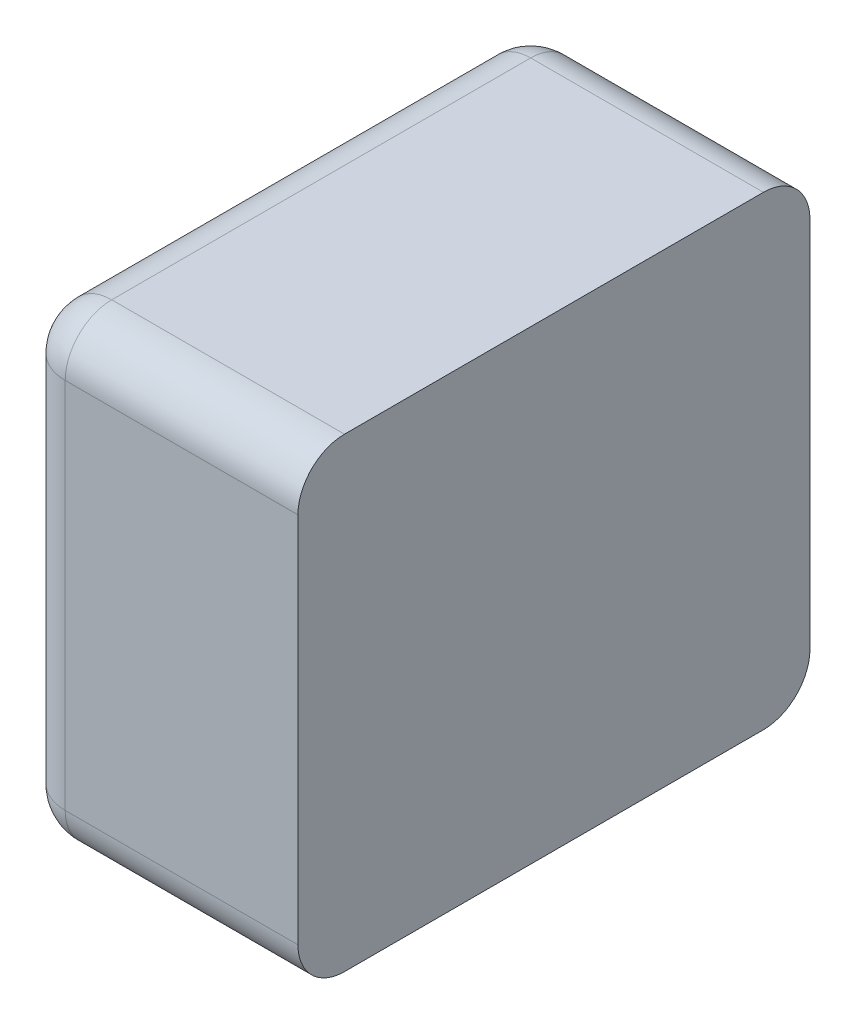
ISO-10303-21;
HEADER;
FILE_DESCRIPTION(('STEP AP214'),'2;1');
FILE_NAME('part.step','',(''),(''),'','','');
FILE_SCHEMA(('AUTOMOTIVE_DESIGN { 1 0 10303 214 1 1 1 1 }'));
ENDSEC;
DATA;
#1=APPLICATION_CONTEXT('core data for automotive mechanical design processes');
#2=APPLICATION_PROTOCOL_DEFINITION('international standard','automotive_design',2000,#1);
#3=PRODUCT_CONTEXT('',#1,'mechanical');
#4=PRODUCT('Part','Part','',(#3));
#5=PRODUCT_RELATED_PRODUCT_CATEGORY('part','',(#4));
#6=PRODUCT_DEFINITION_FORMATION('','',#4);
#7=PRODUCT_DEFINITION_CONTEXT('part definition',#1,'design');
#8=PRODUCT_DEFINITION('design','',#6,#7);
#9=PRODUCT_DEFINITION_SHAPE('','',#8);
#10=(LENGTH_UNIT() NAMED_UNIT(*) SI_UNIT(.MILLI.,.METRE.));
#11=(NAMED_UNIT(*) PLANE_ANGLE_UNIT() SI_UNIT($,.RADIAN.));
#12=(NAMED_UNIT(*) SI_UNIT($,.STERADIAN.) SOLID_ANGLE_UNIT());
#13=UNCERTAINTY_MEASURE_WITH_UNIT(LENGTH_MEASURE(1.E-05),#10,'distance_accuracy_value','');
#14=(GEOMETRIC_REPRESENTATION_CONTEXT(3) GLOBAL_UNCERTAINTY_ASSIGNED_CONTEXT((#13)) GLOBAL_UNIT_ASSIGNED_CONTEXT((#10,
#11,#12)) REPRESENTATION_CONTEXT('',''));
#15=CARTESIAN_POINT('',(0.,0.,0.));
#16=DIRECTION('',(0.,0.,1.));
#17=DIRECTION('',(1.,0.,0.));
#18=AXIS2_PLACEMENT_3D('',#15,#16,#17);
#19=CARTESIAN_POINT('',(-0.5,0.25,0.));
#20=DIRECTION('',(-1.,0.,0.));
#21=DIRECTION('',(0.,0.,1.));
#22=AXIS2_PLACEMENT_3D('',#19,#20,#21);
#23=PLANE('',#22);
#24=DIRECTION('',(0.,-1.,0.));
#25=VECTOR('',#24,1.);
#26=CARTESIAN_POINT('',(-0.5,0.125,0.05));
#27=LINE('',#26,#25);
#28=CARTESIAN_POINT('',(-0.5,-0.2,0.05));
#29=VERTEX_POINT('',#28);
#30=CARTESIAN_POINT('',(-0.5,0.2,0.05));
#31=VERTEX_POINT('',#30);
#32=EDGE_CURVE('E242',#29,#31,#27,.F.);
#33=ORIENTED_EDGE('',*,*,#32,.F.);
#34=DIRECTION('',(0.,0.,1.));
#35=VECTOR('',#34,1.);
#36=CARTESIAN_POINT('',(-0.5,-0.2,0.));
#37=LINE('',#36,#35);
#38=CARTESIAN_POINT('',(-0.5,-0.2,0.5));
#39=VERTEX_POINT('',#38);
#40=EDGE_CURVE('E103',#39,#29,#37,.F.);
#41=ORIENTED_EDGE('',*,*,#40,.F.);
#42=DIRECTION('',(0.,-1.,0.));
#43=VECTOR('',#42,1.);
#44=CARTESIAN_POINT('',(-0.5,0.125,0.5));
#45=LINE('',#44,#43);
#46=CARTESIAN_POINT('',(-0.5,0.2,0.5));
#47=VERTEX_POINT('',#46);
#48=EDGE_CURVE('E227',#47,#39,#45,.T.);
#49=ORIENTED_EDGE('',*,*,#48,.F.);
#50=DIRECTION('',(0.,0.,1.));
#51=VECTOR('',#50,1.);
#52=CARTESIAN_POINT('',(-0.5,0.2,0.));
#53=LINE('',#52,#51);
#54=EDGE_CURVE('E235',#31,#47,#53,.T.);
#55=ORIENTED_EDGE('',*,*,#54,.F.);
#56=EDGE_LOOP('',(#33,#41,#49,#55));
#57=FACE_BOUND('',#56,.T.);
#58=ADVANCED_FACE('F17',(#57),#23,.T.);
#59=CARTESIAN_POINT('',(-0.45,-0.2,0.5));
#60=DIRECTION('',(-0.577350269189626,-0.577350269189626,0.577350269189626));
#61=DIRECTION('',(-0.707106781186548,0.,-0.707106781186548));
#62=AXIS2_PLACEMENT_3D('',#59,#60,#61);
#63=SPHERICAL_SURFACE('',#62,0.05);
#64=CARTESIAN_POINT('',(-0.478867513459481,-0.228867513459481,0.528867513459481));
#65=VERTEX_POINT('',#64);
#66=VERTEX_LOOP('',#65);
#67=FACE_BOUND('',#66,.T.);
#68=CARTESIAN_POINT('',(-0.45,-0.2,0.5));
#69=DIRECTION('',(1.,0.,0.));
#70=DIRECTION('',(0.,0.,-1.));
#71=AXIS2_PLACEMENT_3D('',#68,#69,#70);
#72=CIRCLE('',#71,0.05);
#73=CARTESIAN_POINT('',(-0.45,-0.2,0.55));
#74=VERTEX_POINT('',#73);
#75=CARTESIAN_POINT('',(-0.45,-0.25,0.5));
#76=VERTEX_POINT('',#75);
#77=EDGE_CURVE('E99',#74,#76,#72,.T.);
#78=ORIENTED_EDGE('',*,*,#77,.F.);
#79=CARTESIAN_POINT('',(-0.45,-0.2,0.5));
#80=DIRECTION('',(0.,-1.,0.));
#81=DIRECTION('',(0.,0.,-1.));
#82=AXIS2_PLACEMENT_3D('',#79,#80,#81);
#83=CIRCLE('',#82,0.05);
#84=EDGE_CURVE('E101',#39,#74,#83,.F.);
#85=ORIENTED_EDGE('',*,*,#84,.F.);
#86=CARTESIAN_POINT('',(-0.45,-0.2,0.5));
#87=DIRECTION('',(0.,0.,1.));
#88=DIRECTION('',(1.,0.,0.));
#89=AXIS2_PLACEMENT_3D('',#86,#87,#88);
#90=CIRCLE('',#89,0.05);
#91=EDGE_CURVE('E20',#76,#39,#90,.F.);
#92=ORIENTED_EDGE('',*,*,#91,.F.);
#93=EDGE_LOOP('',(#78,#85,#92));
#94=FACE_BOUND('',#93,.T.);
#95=ADVANCED_FACE('F97',(#67,#94),#63,.T.);
#96=CARTESIAN_POINT('',(-0.45,-0.2,0.));
#97=DIRECTION('',(0.,0.,1.));
#98=DIRECTION('',(1.,0.,0.));
#99=AXIS2_PLACEMENT_3D('',#96,#97,#98);
#100=CYLINDRICAL_SURFACE('',#99,0.05);
#101=ORIENTED_EDGE('',*,*,#91,.T.);
#102=ORIENTED_EDGE('',*,*,#40,.T.);
#103=CARTESIAN_POINT('',(-0.45,-0.2,0.05));
#104=DIRECTION('',(0.,0.,1.));
#105=DIRECTION('',(1.,0.,0.));
#106=AXIS2_PLACEMENT_3D('',#103,#104,#105);
#107=CIRCLE('',#106,0.05);
#108=CARTESIAN_POINT('',(-0.45,-0.25,0.05));
#109=VERTEX_POINT('',#108);
#110=EDGE_CURVE('E108',#109,#29,#107,.F.);
#111=ORIENTED_EDGE('',*,*,#110,.F.);
#112=DIRECTION('',(0.,0.,-1.));
#113=VECTOR('',#112,1.);
#114=CARTESIAN_POINT('',(-0.45,-0.25,0.));
#115=LINE('',#114,#113);
#116=EDGE_CURVE('E105',#76,#109,#115,.T.);
#117=ORIENTED_EDGE('',*,*,#116,.F.);
#118=EDGE_LOOP('',(#101,#102,#111,#117));
#119=FACE_BOUND('',#118,.T.);
#120=ADVANCED_FACE('F106',(#119),#100,.T.);
#121=CARTESIAN_POINT('',(-0.45,-0.2,0.05));
#122=DIRECTION('',(-0.577350269189626,-0.577350269189626,-0.577350269189626));
#123=DIRECTION('',(-0.707106781186548,0.707106781186548,0.));
#124=AXIS2_PLACEMENT_3D('',#121,#122,#123);
#125=SPHERICAL_SURFACE('',#124,0.05);
#126=CARTESIAN_POINT('',(-0.478867513459481,-0.228867513459481,0.0211324865405187));
#127=VERTEX_POINT('',#126);
#128=VERTEX_LOOP('',#127);
#129=FACE_BOUND('',#128,.T.);
#130=CARTESIAN_POINT('',(-0.45,-0.2,0.05));
#131=DIRECTION('',(1.,0.,0.));
#132=DIRECTION('',(0.,0.,-1.));
#133=AXIS2_PLACEMENT_3D('',#130,#131,#132);
#134=CIRCLE('',#133,0.05);
#135=CARTESIAN_POINT('',(-0.45,-0.2,0.));
#136=VERTEX_POINT('',#135);
#137=EDGE_CURVE('E127',#109,#136,#134,.T.);
#138=ORIENTED_EDGE('',*,*,#137,.F.);
#139=ORIENTED_EDGE('',*,*,#110,.T.);
#140=CARTESIAN_POINT('',(-0.45,-0.2,0.05));
#141=DIRECTION('',(0.,-1.,0.));
#142=DIRECTION('',(0.,0.,-1.));
#143=AXIS2_PLACEMENT_3D('',#140,#141,#142);
#144=CIRCLE('',#143,0.05);
#145=EDGE_CURVE('E243',#136,#29,#144,.F.);
#146=ORIENTED_EDGE('',*,*,#145,.F.);
#147=EDGE_LOOP('',(#138,#139,#146));
#148=FACE_BOUND('',#147,.T.);
#149=ADVANCED_FACE('F171',(#129,#148),#125,.T.);
#150=CARTESIAN_POINT('',(-0.45,0.125,0.05));
#151=DIRECTION('',(0.,-1.,0.));
#152=DIRECTION('',(0.,0.,-1.));
#153=AXIS2_PLACEMENT_3D('',#150,#151,#152);
#154=CYLINDRICAL_SURFACE('',#153,0.05);
#155=ORIENTED_EDGE('',*,*,#145,.T.);
#156=ORIENTED_EDGE('',*,*,#32,.T.);
#157=CARTESIAN_POINT('',(-0.45,0.2,0.05));
#158=DIRECTION('',(0.,-1.,0.));
#159=DIRECTION('',(0.,0.,-1.));
#160=AXIS2_PLACEMENT_3D('',#157,#158,#159);
#161=CIRCLE('',#160,0.05);
#162=CARTESIAN_POINT('',(-0.45,0.2,0.));
#163=VERTEX_POINT('',#162);
#164=EDGE_CURVE('E239',#163,#31,#161,.F.);
#165=ORIENTED_EDGE('',*,*,#164,.F.);
#166=DIRECTION('',(0.,1.,0.));
#167=VECTOR('',#166,1.);
#168=CARTESIAN_POINT('',(-0.45,0.,0.));
#169=LINE('',#168,#167);
#170=EDGE_CURVE('E145',#163,#136,#169,.F.);
#171=ORIENTED_EDGE('',*,*,#170,.T.);
#172=EDGE_LOOP('',(#155,#156,#165,#171));
#173=FACE_BOUND('',#172,.T.);
#174=ADVANCED_FACE('F162',(#173),#154,.T.);
#175=CARTESIAN_POINT('',(-0.45,0.2,0.05));
#176=DIRECTION('',(-0.577350269189626,0.577350269189626,-0.577350269189626));
#177=DIRECTION('',(0.707106781186548,0.707106781186548,0.));
#178=AXIS2_PLACEMENT_3D('',#175,#176,#177);
#179=SPHERICAL_SURFACE('',#178,0.05);
#180=CARTESIAN_POINT('',(-0.478867513459481,0.228867513459481,0.0211324865405187));
#181=VERTEX_POINT('',#180);
#182=VERTEX_LOOP('',#181);
#183=FACE_BOUND('',#182,.T.);
#184=CARTESIAN_POINT('',(-0.45,0.2,0.05));
#185=DIRECTION('',(-1.,0.,0.));
#186=DIRECTION('',(0.,0.,1.));
#187=AXIS2_PLACEMENT_3D('',#184,#185,#186);
#188=CIRCLE('',#187,0.05);
#189=CARTESIAN_POINT('',(-0.45,0.25,0.05));
#190=VERTEX_POINT('',#189);
#191=EDGE_CURVE('E265',#163,#190,#188,.F.);
#192=ORIENTED_EDGE('',*,*,#191,.F.);
#193=ORIENTED_EDGE('',*,*,#164,.T.);
#194=CARTESIAN_POINT('',(-0.45,0.2,0.05));
#195=DIRECTION('',(0.,0.,1.));
#196=DIRECTION('',(1.,0.,0.));
#197=AXIS2_PLACEMENT_3D('',#194,#195,#196);
#198=CIRCLE('',#197,0.05);
#199=EDGE_CURVE('E236',#190,#31,#198,.T.);
#200=ORIENTED_EDGE('',*,*,#199,.F.);
#201=EDGE_LOOP('',(#192,#193,#200));
#202=FACE_BOUND('',#201,.T.);
#203=ADVANCED_FACE('F158',(#183,#202),#179,.T.);
#204=CARTESIAN_POINT('',(-0.45,0.2,0.));
#205=DIRECTION('',(0.,0.,1.));
#206=DIRECTION('',(1.,0.,0.));
#207=AXIS2_PLACEMENT_3D('',#204,#205,#206);
#208=CYLINDRICAL_SURFACE('',#207,0.05);
#209=CARTESIAN_POINT('',(-0.45,0.2,0.5));
#210=DIRECTION('',(0.,0.,1.));
#211=DIRECTION('',(1.,0.,0.));
#212=AXIS2_PLACEMENT_3D('',#209,#210,#211);
#213=CIRCLE('',#212,0.05);
#214=CARTESIAN_POINT('',(-0.45,0.25,0.5));
#215=VERTEX_POINT('',#214);
#216=EDGE_CURVE('E232',#215,#47,#213,.T.);
#217=ORIENTED_EDGE('',*,*,#216,.F.);
#218=DIRECTION('',(0.,0.,1.));
#219=VECTOR('',#218,1.);
#220=CARTESIAN_POINT('',(-0.45,0.25,0.));
#221=LINE('',#220,#219);
#222=EDGE_CURVE('E138',#190,#215,#221,.T.);
#223=ORIENTED_EDGE('',*,*,#222,.F.);
#224=ORIENTED_EDGE('',*,*,#199,.T.);
#225=ORIENTED_EDGE('',*,*,#54,.T.);
#226=EDGE_LOOP('',(#217,#223,#224,#225));
#227=FACE_BOUND('',#226,.T.);
#228=ADVANCED_FACE('F153',(#227),#208,.T.);
#229=CARTESIAN_POINT('',(-0.45,0.2,0.5));
#230=DIRECTION('',(-0.577350269189626,0.577350269189626,0.577350269189626));
#231=DIRECTION('',(-0.707106781186548,0.,-0.707106781186548));
#232=AXIS2_PLACEMENT_3D('',#229,#230,#231);
#233=SPHERICAL_SURFACE('',#232,0.05);
#234=CARTESIAN_POINT('',(-0.478867513459481,0.228867513459481,0.528867513459481));
#235=VERTEX_POINT('',#234);
#236=VERTEX_LOOP('',#235);
#237=FACE_BOUND('',#236,.T.);
#238=CARTESIAN_POINT('',(-0.45,0.2,0.5));
#239=DIRECTION('',(-1.,0.,0.));
#240=DIRECTION('',(0.,0.,1.));
#241=AXIS2_PLACEMENT_3D('',#238,#239,#240);
#242=CIRCLE('',#241,0.05);
#243=CARTESIAN_POINT('',(-0.45,0.2,0.55));
#244=VERTEX_POINT('',#243);
#245=EDGE_CURVE('E263',#215,#244,#242,.F.);
#246=ORIENTED_EDGE('',*,*,#245,.F.);
#247=ORIENTED_EDGE('',*,*,#216,.T.);
#248=CARTESIAN_POINT('',(-0.45,0.2,0.5));
#249=DIRECTION('',(0.,-1.,0.));
#250=DIRECTION('',(0.,0.,-1.));
#251=AXIS2_PLACEMENT_3D('',#248,#249,#250);
#252=CIRCLE('',#251,0.05);
#253=EDGE_CURVE('E229',#244,#47,#252,.T.);
#254=ORIENTED_EDGE('',*,*,#253,.F.);
#255=EDGE_LOOP('',(#246,#247,#254));
#256=FACE_BOUND('',#255,.T.);
#257=ADVANCED_FACE('F148',(#237,#256),#233,.T.);
#258=CARTESIAN_POINT('',(-0.45,0.125,0.5));
#259=DIRECTION('',(0.,-1.,0.));
#260=DIRECTION('',(0.,0.,-1.));
#261=AXIS2_PLACEMENT_3D('',#258,#259,#260);
#262=CYLINDRICAL_SURFACE('',#261,0.05);
#263=ORIENTED_EDGE('',*,*,#84,.T.);
#264=DIRECTION('',(0.,1.,0.));
#265=VECTOR('',#264,1.);
#266=CARTESIAN_POINT('',(-0.45,0.,0.55));
#267=LINE('',#266,#265);
#268=EDGE_CURVE('E135',#244,#74,#267,.F.);
#269=ORIENTED_EDGE('',*,*,#268,.F.);
#270=ORIENTED_EDGE('',*,*,#253,.T.);
#271=ORIENTED_EDGE('',*,*,#48,.T.);
#272=EDGE_LOOP('',(#263,#269,#270,#271));
#273=FACE_BOUND('',#272,.T.);
#274=ADVANCED_FACE('F152',(#273),#262,.T.);
#275=CARTESIAN_POINT('',(-0.425,-0.2,0.5));
#276=DIRECTION('',(1.,0.,0.));
#277=DIRECTION('',(0.,0.,-1.));
#278=AXIS2_PLACEMENT_3D('',#275,#276,#277);
#279=CYLINDRICAL_SURFACE('',#278,0.05);
#280=CARTESIAN_POINT('',(-0.2,-0.2,0.5));
#281=DIRECTION('',(1.,0.,0.));
#282=DIRECTION('',(0.,0.,-1.));
#283=AXIS2_PLACEMENT_3D('',#280,#281,#282);
#284=CIRCLE('',#283,0.05);
#285=CARTESIAN_POINT('',(-0.2,-0.2,0.55));
#286=VERTEX_POINT('',#285);
#287=CARTESIAN_POINT('',(-0.2,-0.25,0.5));
#288=VERTEX_POINT('',#287);
#289=EDGE_CURVE('E261',#286,#288,#284,.T.);
#290=ORIENTED_EDGE('',*,*,#289,.F.);
#291=DIRECTION('',(1.,0.,0.));
#292=VECTOR('',#291,1.);
#293=CARTESIAN_POINT('',(-0.35,-0.2,0.55));
#294=LINE('',#293,#292);
#295=EDGE_CURVE('E120',#74,#286,#294,.T.);
#296=ORIENTED_EDGE('',*,*,#295,.F.);
#297=ORIENTED_EDGE('',*,*,#77,.T.);
#298=DIRECTION('',(1.,0.,0.));
#299=VECTOR('',#298,1.);
#300=CARTESIAN_POINT('',(-0.5,-0.25,0.5));
#301=LINE('',#300,#299);
#302=EDGE_CURVE('E113',#288,#76,#301,.F.);
#303=ORIENTED_EDGE('',*,*,#302,.F.);
#304=EDGE_LOOP('',(#290,#296,#297,#303));
#305=FACE_BOUND('',#304,.T.);
#306=ADVANCED_FACE('F117',(#305),#279,.T.);
#307=CARTESIAN_POINT('',(-0.5,-0.25,0.));
#308=DIRECTION('',(0.,-1.,0.));
#309=DIRECTION('',(0.,0.,-1.));
#310=AXIS2_PLACEMENT_3D('',#307,#308,#309);
#311=PLANE('',#310);
#312=DIRECTION('',(0.,0.,-1.));
#313=VECTOR('',#312,1.);
#314=CARTESIAN_POINT('',(-0.2,-0.25,0.));
#315=LINE('',#314,#313);
#316=CARTESIAN_POINT('',(-0.2,-0.25,0.05));
#317=VERTEX_POINT('',#316);
#318=EDGE_CURVE('E125',#288,#317,#315,.T.);
#319=ORIENTED_EDGE('',*,*,#318,.F.);
#320=ORIENTED_EDGE('',*,*,#302,.T.);
#321=ORIENTED_EDGE('',*,*,#116,.T.);
#322=DIRECTION('',(1.,0.,0.));
#323=VECTOR('',#322,1.);
#324=CARTESIAN_POINT('',(-0.425,-0.25,0.05));
#325=LINE('',#324,#323);
#326=EDGE_CURVE('E130',#317,#109,#325,.F.);
#327=ORIENTED_EDGE('',*,*,#326,.F.);
#328=EDGE_LOOP('',(#319,#320,#321,#327));
#329=FACE_BOUND('',#328,.T.);
#330=ADVANCED_FACE('F123',(#329),#311,.T.);
#331=CARTESIAN_POINT('',(-0.425,-0.2,0.05));
#332=DIRECTION('',(1.,0.,0.));
#333=DIRECTION('',(0.,0.,-1.));
#334=AXIS2_PLACEMENT_3D('',#331,#332,#333);
#335=CYLINDRICAL_SURFACE('',#334,0.05);
#336=CARTESIAN_POINT('',(-0.2,-0.2,0.05));
#337=DIRECTION('',(1.,0.,0.));
#338=DIRECTION('',(0.,0.,-1.));
#339=AXIS2_PLACEMENT_3D('',#336,#337,#338);
#340=CIRCLE('',#339,0.05);
#341=CARTESIAN_POINT('',(-0.2,-0.2,0.));
#342=VERTEX_POINT('',#341);
#343=EDGE_CURVE('E258',#317,#342,#340,.T.);
#344=ORIENTED_EDGE('',*,*,#343,.F.);
#345=ORIENTED_EDGE('',*,*,#326,.T.);
#346=ORIENTED_EDGE('',*,*,#137,.T.);
#347=DIRECTION('',(1.,0.,0.));
#348=VECTOR('',#347,1.);
#349=CARTESIAN_POINT('',(-0.35,-0.2,0.));
#350=LINE('',#349,#348);
#351=EDGE_CURVE('E272',#136,#342,#350,.T.);
#352=ORIENTED_EDGE('',*,*,#351,.T.);
#353=EDGE_LOOP('',(#344,#345,#346,#352));
#354=FACE_BOUND('',#353,.T.);
#355=ADVANCED_FACE('F210',(#354),#335,.T.);
#356=CARTESIAN_POINT('',(-0.35,0.,0.));
#357=DIRECTION('',(0.,0.,1.));
#358=DIRECTION('',(1.,0.,0.));
#359=AXIS2_PLACEMENT_3D('',#356,#357,#358);
#360=PLANE('',#359);
#361=DIRECTION('',(-1.,0.,0.));
#362=VECTOR('',#361,1.);
#363=CARTESIAN_POINT('',(-0.275,0.2,0.));
#364=LINE('',#363,#362);
#365=CARTESIAN_POINT('',(-0.2,0.2,0.));
#366=VERTEX_POINT('',#365);
#367=EDGE_CURVE('E142',#366,#163,#364,.T.);
#368=ORIENTED_EDGE('',*,*,#367,.F.);
#369=DIRECTION('',(0.,1.,0.));
#370=VECTOR('',#369,1.);
#371=CARTESIAN_POINT('',(-0.2,-0.25,0.));
#372=LINE('',#371,#370);
#373=EDGE_CURVE('E257',#342,#366,#372,.T.);
#374=ORIENTED_EDGE('',*,*,#373,.F.);
#375=ORIENTED_EDGE('',*,*,#351,.F.);
#376=ORIENTED_EDGE('',*,*,#170,.F.);
#377=EDGE_LOOP('',(#368,#374,#375,#376));
#378=FACE_BOUND('',#377,.T.);
#379=ADVANCED_FACE('F206',(#378),#360,.F.);
#380=CARTESIAN_POINT('',(-0.275,0.2,0.05));
#381=DIRECTION('',(-1.,0.,0.));
#382=DIRECTION('',(0.,0.,1.));
#383=AXIS2_PLACEMENT_3D('',#380,#381,#382);
#384=CYLINDRICAL_SURFACE('',#383,0.05);
#385=CARTESIAN_POINT('',(-0.2,0.2,0.05));
#386=DIRECTION('',(-1.,0.,0.));
#387=DIRECTION('',(0.,0.,1.));
#388=AXIS2_PLACEMENT_3D('',#385,#386,#387);
#389=CIRCLE('',#388,0.05);
#390=CARTESIAN_POINT('',(-0.2,0.25,0.05));
#391=VERTEX_POINT('',#390);
#392=EDGE_CURVE('E254',#366,#391,#389,.F.);
#393=ORIENTED_EDGE('',*,*,#392,.F.);
#394=ORIENTED_EDGE('',*,*,#367,.T.);
#395=ORIENTED_EDGE('',*,*,#191,.T.);
#396=DIRECTION('',(1.,0.,0.));
#397=VECTOR('',#396,1.);
#398=CARTESIAN_POINT('',(-0.2,0.25,0.05));
#399=LINE('',#398,#397);
#400=EDGE_CURVE('E141',#391,#190,#399,.F.);
#401=ORIENTED_EDGE('',*,*,#400,.F.);
#402=EDGE_LOOP('',(#393,#394,#395,#401));
#403=FACE_BOUND('',#402,.T.);
#404=ADVANCED_FACE('F202',(#403),#384,.T.);
#405=CARTESIAN_POINT('',(-0.2,0.25,0.));
#406=DIRECTION('',(0.,1.,0.));
#407=DIRECTION('',(0.,0.,1.));
#408=AXIS2_PLACEMENT_3D('',#405,#406,#407);
#409=PLANE('',#408);
#410=DIRECTION('',(0.,0.,-1.));
#411=VECTOR('',#410,1.);
#412=CARTESIAN_POINT('',(-0.2,0.25,0.));
#413=LINE('',#412,#411);
#414=CARTESIAN_POINT('',(-0.2,0.25,0.5));
#415=VERTEX_POINT('',#414);
#416=EDGE_CURVE('E253',#391,#415,#413,.F.);
#417=ORIENTED_EDGE('',*,*,#416,.F.);
#418=ORIENTED_EDGE('',*,*,#400,.T.);
#419=ORIENTED_EDGE('',*,*,#222,.T.);
#420=DIRECTION('',(-1.,0.,0.));
#421=VECTOR('',#420,1.);
#422=CARTESIAN_POINT('',(-0.275,0.25,0.5));
#423=LINE('',#422,#421);
#424=EDGE_CURVE('E137',#415,#215,#423,.T.);
#425=ORIENTED_EDGE('',*,*,#424,.F.);
#426=EDGE_LOOP('',(#417,#418,#419,#425));
#427=FACE_BOUND('',#426,.T.);
#428=ADVANCED_FACE('F199',(#427),#409,.T.);
#429=CARTESIAN_POINT('',(-0.275,0.2,0.5));
#430=DIRECTION('',(-1.,0.,0.));
#431=DIRECTION('',(0.,0.,1.));
#432=AXIS2_PLACEMENT_3D('',#429,#430,#431);
#433=CYLINDRICAL_SURFACE('',#432,0.05);
#434=CARTESIAN_POINT('',(-0.2,0.2,0.5));
#435=DIRECTION('',(-1.,0.,0.));
#436=DIRECTION('',(0.,0.,1.));
#437=AXIS2_PLACEMENT_3D('',#434,#435,#436);
#438=CIRCLE('',#437,0.05);
#439=CARTESIAN_POINT('',(-0.2,0.2,0.55));
#440=VERTEX_POINT('',#439);
#441=EDGE_CURVE('E26',#415,#440,#438,.F.);
#442=ORIENTED_EDGE('',*,*,#441,.F.);
#443=ORIENTED_EDGE('',*,*,#424,.T.);
#444=ORIENTED_EDGE('',*,*,#245,.T.);
#445=DIRECTION('',(1.,0.,0.));
#446=VECTOR('',#445,1.);
#447=CARTESIAN_POINT('',(-0.35,0.2,0.55));
#448=LINE('',#447,#446);
#449=EDGE_CURVE('E35',#440,#244,#448,.F.);
#450=ORIENTED_EDGE('',*,*,#449,.F.);
#451=EDGE_LOOP('',(#442,#443,#444,#450));
#452=FACE_BOUND('',#451,.T.);
#453=ADVANCED_FACE('F192',(#452),#433,.T.);
#454=CARTESIAN_POINT('',(-0.35,0.,0.55));
#455=DIRECTION('',(0.,0.,1.));
#456=DIRECTION('',(1.,0.,0.));
#457=AXIS2_PLACEMENT_3D('',#454,#455,#456);
#458=PLANE('',#457);
#459=DIRECTION('',(0.,1.,0.));
#460=VECTOR('',#459,1.);
#461=CARTESIAN_POINT('',(-0.2,-0.25,0.55));
#462=LINE('',#461,#460);
#463=EDGE_CURVE('E11',#440,#286,#462,.F.);
#464=ORIENTED_EDGE('',*,*,#463,.F.);
#465=ORIENTED_EDGE('',*,*,#449,.T.);
#466=ORIENTED_EDGE('',*,*,#268,.T.);
#467=ORIENTED_EDGE('',*,*,#295,.T.);
#468=EDGE_LOOP('',(#464,#465,#466,#467));
#469=FACE_BOUND('',#468,.T.);
#470=ADVANCED_FACE('F186',(#469),#458,.T.);
#471=CARTESIAN_POINT('',(-0.2,-0.25,0.));
#472=DIRECTION('',(1.,0.,0.));
#473=DIRECTION('',(0.,0.,-1.));
#474=AXIS2_PLACEMENT_3D('',#471,#472,#473);
#475=PLANE('',#474);
#476=ORIENTED_EDGE('',*,*,#441,.T.);
#477=ORIENTED_EDGE('',*,*,#463,.T.);
#478=ORIENTED_EDGE('',*,*,#289,.T.);
#479=ORIENTED_EDGE('',*,*,#318,.T.);
#480=ORIENTED_EDGE('',*,*,#343,.T.);
#481=ORIENTED_EDGE('',*,*,#373,.T.);
#482=ORIENTED_EDGE('',*,*,#392,.T.);
#483=ORIENTED_EDGE('',*,*,#416,.T.);
#484=EDGE_LOOP('',(#476,#477,#478,#479,#480,#481,#482,#483));
#485=FACE_BOUND('',#484,.T.);
#486=ADVANCED_FACE('F184',(#485),#475,.T.);
#487=CLOSED_SHELL('',(#58,#95,#120,#149,#174,#203,#228,#257,#274,#306,#330,#355,#379,#404,#428,
#453,#470,#486));
#488=MANIFOLD_SOLID_BREP('B1',#487);
#489=ADVANCED_BREP_SHAPE_REPRESENTATION('',(#18,#488),#14);
#490=SHAPE_DEFINITION_REPRESENTATION(#9,#489);
ENDSEC;
END-ISO-10303-21;
